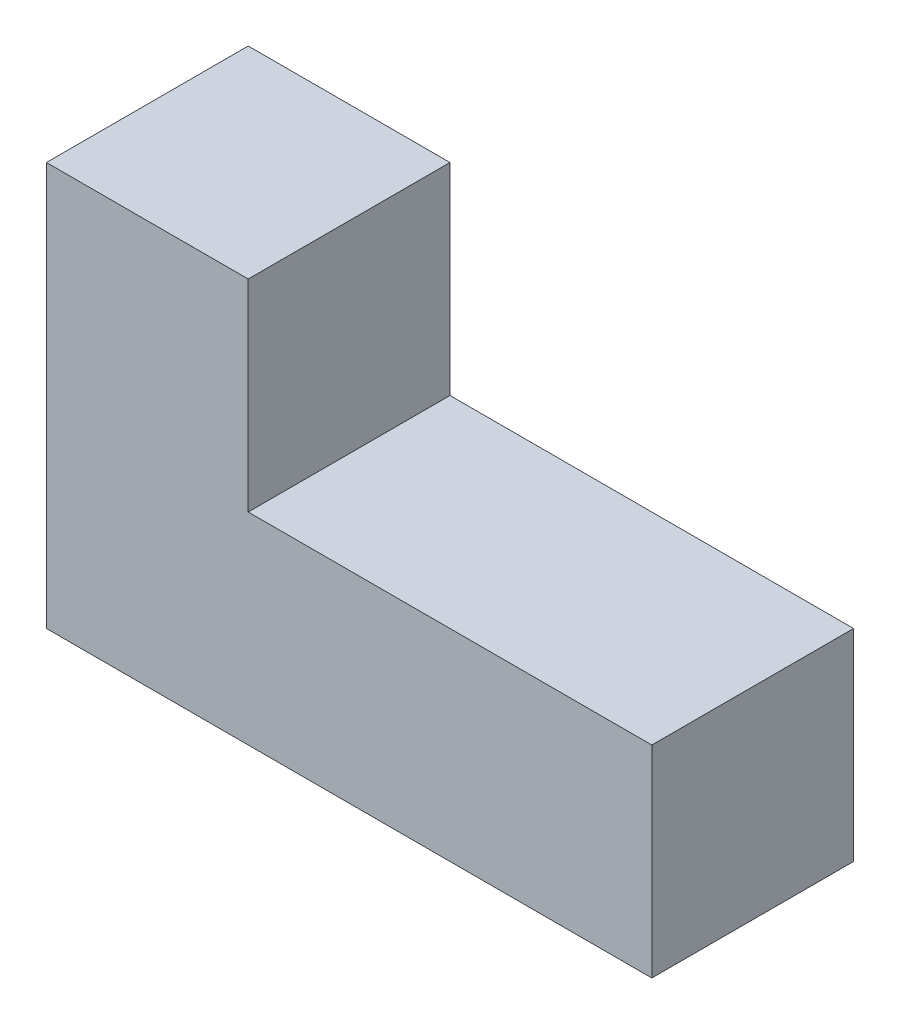
ISO-10303-21;
HEADER;
FILE_DESCRIPTION(('STEP AP214'),'2;1');
FILE_NAME('part.step','',(''),(''),'','','');
FILE_SCHEMA(('AUTOMOTIVE_DESIGN { 1 0 10303 214 1 1 1 1 }'));
ENDSEC;
DATA;
#1=APPLICATION_CONTEXT('core data for automotive mechanical design processes');
#2=APPLICATION_PROTOCOL_DEFINITION('international standard','automotive_design',2000,#1);
#3=PRODUCT_CONTEXT('',#1,'mechanical');
#4=PRODUCT('Part','Part','',(#3));
#5=PRODUCT_RELATED_PRODUCT_CATEGORY('part','',(#4));
#6=PRODUCT_DEFINITION_FORMATION('','',#4);
#7=PRODUCT_DEFINITION_CONTEXT('part definition',#1,'design');
#8=PRODUCT_DEFINITION('design','',#6,#7);
#9=PRODUCT_DEFINITION_SHAPE('','',#8);
#10=(LENGTH_UNIT() NAMED_UNIT(*) SI_UNIT(.MILLI.,.METRE.));
#11=(NAMED_UNIT(*) PLANE_ANGLE_UNIT() SI_UNIT($,.RADIAN.));
#12=(NAMED_UNIT(*) SI_UNIT($,.STERADIAN.) SOLID_ANGLE_UNIT());
#13=UNCERTAINTY_MEASURE_WITH_UNIT(LENGTH_MEASURE(1.E-05),#10,'distance_accuracy_value','');
#14=(GEOMETRIC_REPRESENTATION_CONTEXT(3) GLOBAL_UNCERTAINTY_ASSIGNED_CONTEXT((#13)) GLOBAL_UNIT_ASSIGNED_CONTEXT((#10,
#11,#12)) REPRESENTATION_CONTEXT('',''));
#15=CARTESIAN_POINT('',(0.,0.,0.));
#16=DIRECTION('',(0.,0.,1.));
#17=DIRECTION('',(1.,0.,0.));
#18=AXIS2_PLACEMENT_3D('',#15,#16,#17);
#19=CARTESIAN_POINT('',(0.,60.,30.));
#20=DIRECTION('',(1.,0.,0.));
#21=DIRECTION('',(0.,0.,-1.));
#22=AXIS2_PLACEMENT_3D('',#19,#20,#21);
#23=PLANE('',#22);
#24=DIRECTION('',(0.,-1.,0.));
#25=VECTOR('',#24,1.);
#26=CARTESIAN_POINT('',(0.,60.,0.));
#27=LINE('',#26,#25);
#28=CARTESIAN_POINT('',(0.,60.,0.));
#29=VERTEX_POINT('',#28);
#30=CARTESIAN_POINT('',(0.,0.,0.));
#31=VERTEX_POINT('',#30);
#32=EDGE_CURVE('E132',#29,#31,#27,.T.);
#33=ORIENTED_EDGE('',*,*,#32,.T.);
#34=DIRECTION('',(0.,0.,-1.));
#35=VECTOR('',#34,1.);
#36=CARTESIAN_POINT('',(0.,0.,30.));
#37=LINE('',#36,#35);
#38=CARTESIAN_POINT('',(0.,0.,30.));
#39=VERTEX_POINT('',#38);
#40=EDGE_CURVE('E11',#39,#31,#37,.T.);
#41=ORIENTED_EDGE('',*,*,#40,.F.);
#42=DIRECTION('',(0.,-1.,0.));
#43=VECTOR('',#42,1.);
#44=CARTESIAN_POINT('',(0.,60.,30.));
#45=LINE('',#44,#43);
#46=CARTESIAN_POINT('',(0.,60.,30.));
#47=VERTEX_POINT('',#46);
#48=EDGE_CURVE('E148',#47,#39,#45,.T.);
#49=ORIENTED_EDGE('',*,*,#48,.F.);
#50=DIRECTION('',(0.,0.,-1.));
#51=VECTOR('',#50,1.);
#52=CARTESIAN_POINT('',(0.,60.,30.));
#53=LINE('',#52,#51);
#54=EDGE_CURVE('E128',#47,#29,#53,.T.);
#55=ORIENTED_EDGE('',*,*,#54,.T.);
#56=EDGE_LOOP('',(#33,#41,#49,#55));
#57=FACE_BOUND('',#56,.T.);
#58=ADVANCED_FACE('F43',(#57),#23,.F.);
#59=CARTESIAN_POINT('',(0.,0.,30.));
#60=DIRECTION('',(0.,1.,0.));
#61=DIRECTION('',(0.,0.,1.));
#62=AXIS2_PLACEMENT_3D('',#59,#60,#61);
#63=PLANE('',#62);
#64=DIRECTION('',(1.,0.,0.));
#65=VECTOR('',#64,1.);
#66=CARTESIAN_POINT('',(0.,0.,0.));
#67=LINE('',#66,#65);
#68=CARTESIAN_POINT('',(90.,0.,0.));
#69=VERTEX_POINT('',#68);
#70=EDGE_CURVE('E136',#31,#69,#67,.T.);
#71=ORIENTED_EDGE('',*,*,#70,.T.);
#72=DIRECTION('',(0.,0.,-1.));
#73=VECTOR('',#72,1.);
#74=CARTESIAN_POINT('',(90.,0.,30.));
#75=LINE('',#74,#73);
#76=CARTESIAN_POINT('',(90.,0.,30.));
#77=VERTEX_POINT('',#76);
#78=EDGE_CURVE('E52',#77,#69,#75,.T.);
#79=ORIENTED_EDGE('',*,*,#78,.F.);
#80=DIRECTION('',(1.,0.,0.));
#81=VECTOR('',#80,1.);
#82=CARTESIAN_POINT('',(0.,0.,30.));
#83=LINE('',#82,#81);
#84=EDGE_CURVE('E97',#39,#77,#83,.T.);
#85=ORIENTED_EDGE('',*,*,#84,.F.);
#86=ORIENTED_EDGE('',*,*,#40,.T.);
#87=EDGE_LOOP('',(#71,#79,#85,#86));
#88=FACE_BOUND('',#87,.T.);
#89=ADVANCED_FACE('F176',(#88),#63,.F.);
#90=CARTESIAN_POINT('',(90.,0.,30.));
#91=DIRECTION('',(-1.,0.,0.));
#92=DIRECTION('',(0.,0.,1.));
#93=AXIS2_PLACEMENT_3D('',#90,#91,#92);
#94=PLANE('',#93);
#95=DIRECTION('',(0.,1.,0.));
#96=VECTOR('',#95,1.);
#97=CARTESIAN_POINT('',(90.,0.,0.));
#98=LINE('',#97,#96);
#99=CARTESIAN_POINT('',(90.,30.,0.));
#100=VERTEX_POINT('',#99);
#101=EDGE_CURVE('E139',#69,#100,#98,.T.);
#102=ORIENTED_EDGE('',*,*,#101,.T.);
#103=DIRECTION('',(0.,0.,-1.));
#104=VECTOR('',#103,1.);
#105=CARTESIAN_POINT('',(90.,30.,30.));
#106=LINE('',#105,#104);
#107=CARTESIAN_POINT('',(90.,30.,30.));
#108=VERTEX_POINT('',#107);
#109=EDGE_CURVE('E121',#108,#100,#106,.T.);
#110=ORIENTED_EDGE('',*,*,#109,.F.);
#111=DIRECTION('',(0.,1.,0.));
#112=VECTOR('',#111,1.);
#113=CARTESIAN_POINT('',(90.,0.,30.));
#114=LINE('',#113,#112);
#115=EDGE_CURVE('E110',#77,#108,#114,.T.);
#116=ORIENTED_EDGE('',*,*,#115,.F.);
#117=ORIENTED_EDGE('',*,*,#78,.T.);
#118=EDGE_LOOP('',(#102,#110,#116,#117));
#119=FACE_BOUND('',#118,.T.);
#120=ADVANCED_FACE('F158',(#119),#94,.F.);
#121=CARTESIAN_POINT('',(90.,30.,30.));
#122=DIRECTION('',(0.,-1.,0.));
#123=DIRECTION('',(0.,0.,-1.));
#124=AXIS2_PLACEMENT_3D('',#121,#122,#123);
#125=PLANE('',#124);
#126=DIRECTION('',(-1.,0.,0.));
#127=VECTOR('',#126,1.);
#128=CARTESIAN_POINT('',(90.,30.,0.));
#129=LINE('',#128,#127);
#130=CARTESIAN_POINT('',(30.,30.,0.));
#131=VERTEX_POINT('',#130);
#132=EDGE_CURVE('E119',#100,#131,#129,.T.);
#133=ORIENTED_EDGE('',*,*,#132,.T.);
#134=DIRECTION('',(0.,0.,-1.));
#135=VECTOR('',#134,1.);
#136=CARTESIAN_POINT('',(30.,30.,30.));
#137=LINE('',#136,#135);
#138=CARTESIAN_POINT('',(30.,30.,30.));
#139=VERTEX_POINT('',#138);
#140=EDGE_CURVE('E116',#139,#131,#137,.T.);
#141=ORIENTED_EDGE('',*,*,#140,.F.);
#142=DIRECTION('',(-1.,0.,0.));
#143=VECTOR('',#142,1.);
#144=CARTESIAN_POINT('',(90.,30.,30.));
#145=LINE('',#144,#143);
#146=EDGE_CURVE('E104',#108,#139,#145,.T.);
#147=ORIENTED_EDGE('',*,*,#146,.F.);
#148=ORIENTED_EDGE('',*,*,#109,.T.);
#149=EDGE_LOOP('',(#133,#141,#147,#148));
#150=FACE_BOUND('',#149,.T.);
#151=ADVANCED_FACE('F117',(#150),#125,.F.);
#152=CARTESIAN_POINT('',(30.,30.,30.));
#153=DIRECTION('',(-1.,0.,0.));
#154=DIRECTION('',(0.,0.,1.));
#155=AXIS2_PLACEMENT_3D('',#152,#153,#154);
#156=PLANE('',#155);
#157=DIRECTION('',(0.,1.,0.));
#158=VECTOR('',#157,1.);
#159=CARTESIAN_POINT('',(30.,30.,0.));
#160=LINE('',#159,#158);
#161=CARTESIAN_POINT('',(30.,60.,0.));
#162=VERTEX_POINT('',#161);
#163=EDGE_CURVE('E83',#131,#162,#160,.T.);
#164=ORIENTED_EDGE('',*,*,#163,.T.);
#165=DIRECTION('',(0.,0.,-1.));
#166=VECTOR('',#165,1.);
#167=CARTESIAN_POINT('',(30.,60.,30.));
#168=LINE('',#167,#166);
#169=CARTESIAN_POINT('',(30.,60.,30.));
#170=VERTEX_POINT('',#169);
#171=EDGE_CURVE('E122',#170,#162,#168,.T.);
#172=ORIENTED_EDGE('',*,*,#171,.F.);
#173=DIRECTION('',(0.,1.,0.));
#174=VECTOR('',#173,1.);
#175=CARTESIAN_POINT('',(30.,30.,30.));
#176=LINE('',#175,#174);
#177=EDGE_CURVE('E108',#139,#170,#176,.T.);
#178=ORIENTED_EDGE('',*,*,#177,.F.);
#179=ORIENTED_EDGE('',*,*,#140,.T.);
#180=EDGE_LOOP('',(#164,#172,#178,#179));
#181=FACE_BOUND('',#180,.T.);
#182=ADVANCED_FACE('F124',(#181),#156,.F.);
#183=CARTESIAN_POINT('',(30.,60.,30.));
#184=DIRECTION('',(0.,-1.,0.));
#185=DIRECTION('',(0.,0.,-1.));
#186=AXIS2_PLACEMENT_3D('',#183,#184,#185);
#187=PLANE('',#186);
#188=DIRECTION('',(-1.,0.,0.));
#189=VECTOR('',#188,1.);
#190=CARTESIAN_POINT('',(30.,60.,0.));
#191=LINE('',#190,#189);
#192=EDGE_CURVE('E89',#162,#29,#191,.T.);
#193=ORIENTED_EDGE('',*,*,#192,.T.);
#194=ORIENTED_EDGE('',*,*,#54,.F.);
#195=DIRECTION('',(-1.,0.,0.));
#196=VECTOR('',#195,1.);
#197=CARTESIAN_POINT('',(30.,60.,30.));
#198=LINE('',#197,#196);
#199=EDGE_CURVE('E60',#170,#47,#198,.T.);
#200=ORIENTED_EDGE('',*,*,#199,.F.);
#201=ORIENTED_EDGE('',*,*,#171,.T.);
#202=EDGE_LOOP('',(#193,#194,#200,#201));
#203=FACE_BOUND('',#202,.T.);
#204=ADVANCED_FACE('F165',(#203),#187,.F.);
#205=CARTESIAN_POINT('',(0.,0.,30.));
#206=DIRECTION('',(0.,0.,1.));
#207=DIRECTION('',(1.,0.,0.));
#208=AXIS2_PLACEMENT_3D('',#205,#206,#207);
#209=PLANE('',#208);
#210=ORIENTED_EDGE('',*,*,#48,.T.);
#211=ORIENTED_EDGE('',*,*,#84,.T.);
#212=ORIENTED_EDGE('',*,*,#115,.T.);
#213=ORIENTED_EDGE('',*,*,#146,.T.);
#214=ORIENTED_EDGE('',*,*,#177,.T.);
#215=ORIENTED_EDGE('',*,*,#199,.T.);
#216=EDGE_LOOP('',(#210,#211,#212,#213,#214,#215));
#217=FACE_BOUND('',#216,.T.);
#218=ADVANCED_FACE('F106',(#217),#209,.T.);
#219=CARTESIAN_POINT('',(0.,0.,0.));
#220=DIRECTION('',(0.,0.,1.));
#221=DIRECTION('',(1.,0.,0.));
#222=AXIS2_PLACEMENT_3D('',#219,#220,#221);
#223=PLANE('',#222);
#224=ORIENTED_EDGE('',*,*,#32,.F.);
#225=ORIENTED_EDGE('',*,*,#192,.F.);
#226=ORIENTED_EDGE('',*,*,#163,.F.);
#227=ORIENTED_EDGE('',*,*,#132,.F.);
#228=ORIENTED_EDGE('',*,*,#101,.F.);
#229=ORIENTED_EDGE('',*,*,#70,.F.);
#230=EDGE_LOOP('',(#224,#225,#226,#227,#228,#229));
#231=FACE_BOUND('',#230,.T.);
#232=ADVANCED_FACE('F161',(#231),#223,.F.);
#233=CLOSED_SHELL('',(#58,#89,#120,#151,#182,#204,#218,#232));
#234=MANIFOLD_SOLID_BREP('B2',#233);
#235=ADVANCED_BREP_SHAPE_REPRESENTATION('',(#18,#234),#14);
#236=SHAPE_DEFINITION_REPRESENTATION(#9,#235);
ENDSEC;
END-ISO-10303-21;
